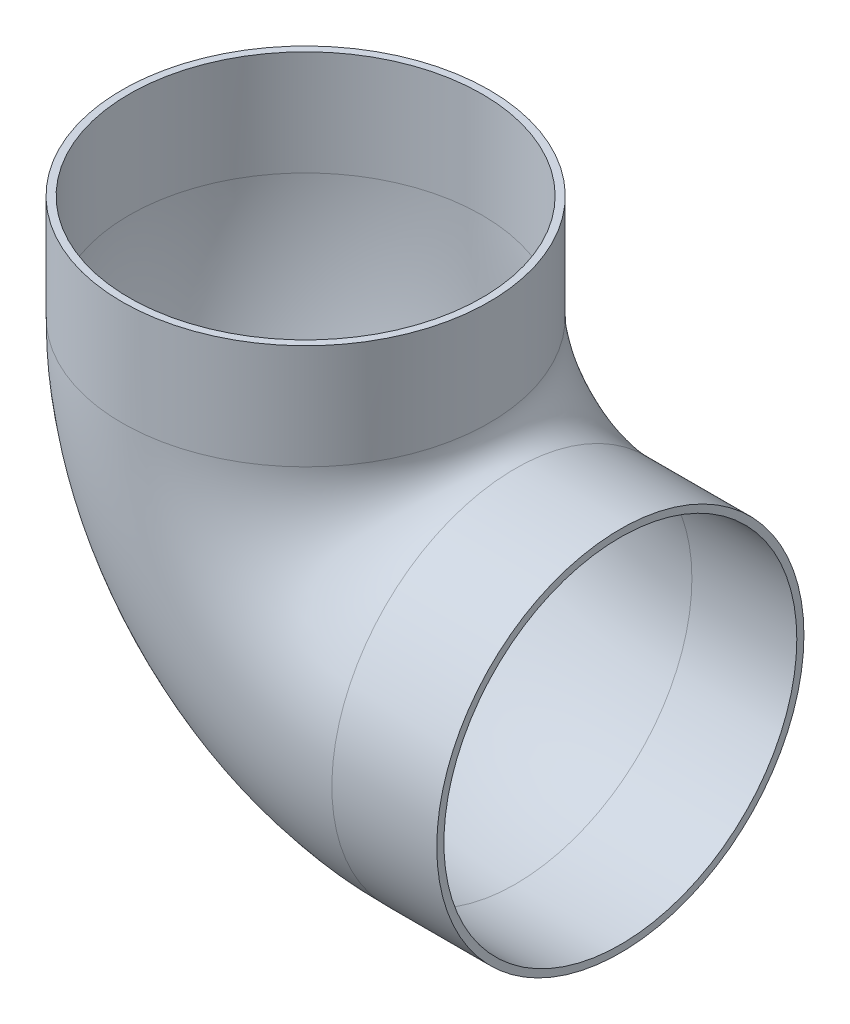
ISO-10303-21;
HEADER;
FILE_DESCRIPTION(('STEP AP214'),'2;1');
FILE_NAME('part.step','',(''),(''),'','','');
FILE_SCHEMA(('AUTOMOTIVE_DESIGN { 1 0 10303 214 1 1 1 1 }'));
ENDSEC;
DATA;
#1=APPLICATION_CONTEXT('core data for automotive mechanical design processes');
#2=APPLICATION_PROTOCOL_DEFINITION('international standard','automotive_design',2000,#1);
#3=PRODUCT_CONTEXT('',#1,'mechanical');
#4=PRODUCT('Part','Part','',(#3));
#5=PRODUCT_RELATED_PRODUCT_CATEGORY('part','',(#4));
#6=PRODUCT_DEFINITION_FORMATION('','',#4);
#7=PRODUCT_DEFINITION_CONTEXT('part definition',#1,'design');
#8=PRODUCT_DEFINITION('design','',#6,#7);
#9=PRODUCT_DEFINITION_SHAPE('','',#8);
#10=(LENGTH_UNIT() NAMED_UNIT(*) SI_UNIT(.MILLI.,.METRE.));
#11=(NAMED_UNIT(*) PLANE_ANGLE_UNIT() SI_UNIT($,.RADIAN.));
#12=(NAMED_UNIT(*) SI_UNIT($,.STERADIAN.) SOLID_ANGLE_UNIT());
#13=UNCERTAINTY_MEASURE_WITH_UNIT(LENGTH_MEASURE(1.E-05),#10,'distance_accuracy_value','');
#14=(GEOMETRIC_REPRESENTATION_CONTEXT(3) GLOBAL_UNCERTAINTY_ASSIGNED_CONTEXT((#13)) GLOBAL_UNIT_ASSIGNED_CONTEXT((#10,
#11,#12)) REPRESENTATION_CONTEXT('',''));
#15=CARTESIAN_POINT('',(0.,0.,0.));
#16=DIRECTION('',(0.,0.,1.));
#17=DIRECTION('',(1.,0.,0.));
#18=AXIS2_PLACEMENT_3D('',#15,#16,#17);
#19=CARTESIAN_POINT('',(-18.2819336381959,1.9177575258447,0.));
#20=DIRECTION('',(0.,-1.,0.));
#21=DIRECTION('',(1.,0.,0.));
#22=AXIS2_PLACEMENT_3D('',#19,#20,#21);
#23=CYLINDRICAL_SURFACE('',#22,11.1125);
#24=CARTESIAN_POINT('',(-18.2819336381959,-4.4322424741553,0.));
#25=DIRECTION('',(0.,-1.,0.));
#26=DIRECTION('',(0.,0.,-1.));
#27=AXIS2_PLACEMENT_3D('',#24,#25,#26);
#28=CIRCLE('',#27,11.1125);
#29=CARTESIAN_POINT('',(-29.3944336381959,-4.4322424741553,0.));
#30=VERTEX_POINT('',#29);
#31=EDGE_CURVE('E83',#30,#30,#28,.T.);
#32=ORIENTED_EDGE('',*,*,#31,.F.);
#33=EDGE_LOOP('',(#32));
#34=FACE_BOUND('',#33,.T.);
#35=CARTESIAN_POINT('',(-18.2819336381959,1.9177575258447,0.));
#36=DIRECTION('',(0.,-1.,0.));
#37=DIRECTION('',(0.,0.,-1.));
#38=AXIS2_PLACEMENT_3D('',#35,#36,#37);
#39=CIRCLE('',#38,11.1125);
#40=CARTESIAN_POINT('',(-18.2819336381959,1.9177575258447,-11.1125));
#41=VERTEX_POINT('',#40);
#42=EDGE_CURVE('E52',#41,#41,#39,.T.);
#43=ORIENTED_EDGE('',*,*,#42,.T.);
#44=EDGE_LOOP('',(#43));
#45=FACE_BOUND('',#44,.T.);
#46=ADVANCED_FACE('F37',(#34,#45),#23,.T.);
#47=CARTESIAN_POINT('',(-5.58193363819594,-4.4322424741553,0.));
#48=DIRECTION('',(0.,0.,1.));
#49=DIRECTION('',(1.,0.,0.));
#50=AXIS2_PLACEMENT_3D('',#47,#48,#49);
#51=TOROIDAL_SURFACE('',#50,12.7,11.1125);
#52=CARTESIAN_POINT('',(-5.58193363819594,-17.1322424741553,0.));
#53=DIRECTION('',(1.,0.,0.));
#54=DIRECTION('',(0.,0.,-1.));
#55=AXIS2_PLACEMENT_3D('',#52,#53,#54);
#56=CIRCLE('',#55,11.1125);
#57=CARTESIAN_POINT('',(-5.58193363819593,-28.2447424741553,0.));
#58=VERTEX_POINT('',#57);
#59=EDGE_CURVE('E41',#58,#58,#56,.T.);
#60=CARTESIAN_POINT('',(-5.58193363819594,-4.4322424741553,0.));
#61=DIRECTION('',(0.,0.,1.));
#62=DIRECTION('',(1.,0.,0.));
#63=AXIS2_PLACEMENT_3D('',#60,#61,#62);
#64=CIRCLE('',#63,23.8125);
#65=EDGE_CURVE('',#30,#58,#64,.T.);
#66=ORIENTED_EDGE('',*,*,#31,.T.);
#67=ORIENTED_EDGE('',*,*,#59,.F.);
#68=ORIENTED_EDGE('',*,*,#65,.T.);
#69=ORIENTED_EDGE('',*,*,#65,.F.);
#70=EDGE_LOOP('',(#66,#68,#67,#69));
#71=FACE_BOUND('',#70,.T.);
#72=ADVANCED_FACE('F91',(#71),#51,.T.);
#73=CARTESIAN_POINT('',(-5.58193363819594,-17.1322424741553,0.));
#74=DIRECTION('',(1.,0.,0.));
#75=DIRECTION('',(0.,0.,-1.));
#76=AXIS2_PLACEMENT_3D('',#73,#74,#75);
#77=CYLINDRICAL_SURFACE('',#76,11.1125);
#78=CARTESIAN_POINT('',(0.768066361804061,-17.1322424741553,0.));
#79=DIRECTION('',(1.,0.,0.));
#80=DIRECTION('',(0.,0.,-1.));
#81=AXIS2_PLACEMENT_3D('',#78,#79,#80);
#82=CIRCLE('',#81,11.1125);
#83=CARTESIAN_POINT('',(0.768066361804061,-17.1322424741553,-11.1125));
#84=VERTEX_POINT('',#83);
#85=EDGE_CURVE('E57',#84,#84,#82,.T.);
#86=ORIENTED_EDGE('',*,*,#85,.F.);
#87=EDGE_LOOP('',(#86));
#88=FACE_BOUND('',#87,.T.);
#89=ORIENTED_EDGE('',*,*,#59,.T.);
#90=EDGE_LOOP('',(#89));
#91=FACE_BOUND('',#90,.T.);
#92=ADVANCED_FACE('F39',(#88,#91),#77,.T.);
#93=CARTESIAN_POINT('',(-18.2819336381959,1.9177575258447,0.));
#94=DIRECTION('',(0.,-1.,0.));
#95=DIRECTION('',(0.,0.,-1.));
#96=AXIS2_PLACEMENT_3D('',#93,#94,#95);
#97=PLANE('',#96);
#98=CARTESIAN_POINT('',(-18.2819336381959,1.9177575258447,0.));
#99=DIRECTION('',(0.,-1.,0.));
#100=DIRECTION('',(0.,0.,-1.));
#101=AXIS2_PLACEMENT_3D('',#98,#99,#100);
#102=CIRCLE('',#101,10.6807);
#103=CARTESIAN_POINT('',(-18.2819336381959,1.9177575258447,-10.6807));
#104=VERTEX_POINT('',#103);
#105=EDGE_CURVE('E78',#104,#104,#102,.F.);
#106=ORIENTED_EDGE('',*,*,#105,.F.);
#107=EDGE_LOOP('',(#106));
#108=FACE_BOUND('',#107,.T.);
#109=ORIENTED_EDGE('',*,*,#42,.F.);
#110=EDGE_LOOP('',(#109));
#111=FACE_BOUND('',#110,.T.);
#112=ADVANCED_FACE('F97',(#108,#111),#97,.F.);
#113=CARTESIAN_POINT('',(0.768066361804061,-17.1322424741553,0.));
#114=DIRECTION('',(1.,0.,0.));
#115=DIRECTION('',(0.,0.,-1.));
#116=AXIS2_PLACEMENT_3D('',#113,#114,#115);
#117=PLANE('',#116);
#118=CARTESIAN_POINT('',(0.768066361804061,-17.1322424741553,0.));
#119=DIRECTION('',(1.,0.,0.));
#120=DIRECTION('',(0.,0.,-1.));
#121=AXIS2_PLACEMENT_3D('',#118,#119,#120);
#122=CIRCLE('',#121,10.6807);
#123=CARTESIAN_POINT('',(0.768066361804061,-17.1322424741553,-10.6807));
#124=VERTEX_POINT('',#123);
#125=EDGE_CURVE('E11',#124,#124,#122,.F.);
#126=ORIENTED_EDGE('',*,*,#125,.T.);
#127=EDGE_LOOP('',(#126));
#128=FACE_BOUND('',#127,.T.);
#129=ORIENTED_EDGE('',*,*,#85,.T.);
#130=EDGE_LOOP('',(#129));
#131=FACE_BOUND('',#130,.T.);
#132=ADVANCED_FACE('F64',(#128,#131),#117,.T.);
#133=CARTESIAN_POINT('',(-18.2819336381959,1.9177575258447,0.));
#134=DIRECTION('',(0.,-1.,0.));
#135=DIRECTION('',(1.,0.,0.));
#136=AXIS2_PLACEMENT_3D('',#133,#134,#135);
#137=CYLINDRICAL_SURFACE('',#136,10.6807);
#138=CARTESIAN_POINT('',(-18.2819336381959,-4.4322424741553,0.));
#139=DIRECTION('',(0.,-1.,0.));
#140=DIRECTION('',(0.,0.,-1.));
#141=AXIS2_PLACEMENT_3D('',#138,#139,#140);
#142=CIRCLE('',#141,10.6807);
#143=CARTESIAN_POINT('',(-28.9626336381959,-4.4322424741553,0.));
#144=VERTEX_POINT('',#143);
#145=EDGE_CURVE('E75',#144,#144,#142,.F.);
#146=ORIENTED_EDGE('',*,*,#145,.F.);
#147=EDGE_LOOP('',(#146));
#148=FACE_BOUND('',#147,.T.);
#149=ORIENTED_EDGE('',*,*,#105,.T.);
#150=EDGE_LOOP('',(#149));
#151=FACE_BOUND('',#150,.T.);
#152=ADVANCED_FACE('F105',(#148,#151),#137,.F.);
#153=CARTESIAN_POINT('',(-5.58193363819594,-4.4322424741553,0.));
#154=DIRECTION('',(0.,0.,1.));
#155=DIRECTION('',(1.,0.,0.));
#156=AXIS2_PLACEMENT_3D('',#153,#154,#155);
#157=TOROIDAL_SURFACE('',#156,12.7,10.6807);
#158=CARTESIAN_POINT('',(-5.58193363819594,-17.1322424741553,0.));
#159=DIRECTION('',(1.,0.,0.));
#160=DIRECTION('',(0.,0.,-1.));
#161=AXIS2_PLACEMENT_3D('',#158,#159,#160);
#162=CIRCLE('',#161,10.6807);
#163=CARTESIAN_POINT('',(-5.58193363819593,-27.8129424741553,0.));
#164=VERTEX_POINT('',#163);
#165=EDGE_CURVE('E46',#164,#164,#162,.F.);
#166=CARTESIAN_POINT('',(-5.58193363819594,-4.4322424741553,0.));
#167=DIRECTION('',(0.,0.,1.));
#168=DIRECTION('',(1.,0.,0.));
#169=AXIS2_PLACEMENT_3D('',#166,#167,#168);
#170=CIRCLE('',#169,23.3807);
#171=EDGE_CURVE('',#144,#164,#170,.T.);
#172=ORIENTED_EDGE('',*,*,#145,.T.);
#173=ORIENTED_EDGE('',*,*,#165,.F.);
#174=ORIENTED_EDGE('',*,*,#171,.T.);
#175=ORIENTED_EDGE('',*,*,#171,.F.);
#176=EDGE_LOOP('',(#172,#174,#173,#175));
#177=FACE_BOUND('',#176,.T.);
#178=ADVANCED_FACE('F70',(#177),#157,.F.);
#179=CARTESIAN_POINT('',(-5.58193363819594,-17.1322424741553,0.));
#180=DIRECTION('',(1.,0.,0.));
#181=DIRECTION('',(0.,0.,-1.));
#182=AXIS2_PLACEMENT_3D('',#179,#180,#181);
#183=CYLINDRICAL_SURFACE('',#182,10.6807);
#184=ORIENTED_EDGE('',*,*,#125,.F.);
#185=EDGE_LOOP('',(#184));
#186=FACE_BOUND('',#185,.T.);
#187=ORIENTED_EDGE('',*,*,#165,.T.);
#188=EDGE_LOOP('',(#187));
#189=FACE_BOUND('',#188,.T.);
#190=ADVANCED_FACE('F67',(#186,#189),#183,.F.);
#191=CLOSED_SHELL('',(#46,#72,#92,#112,#132,#152,#178,#190));
#192=MANIFOLD_SOLID_BREP('B2',#191);
#193=ADVANCED_BREP_SHAPE_REPRESENTATION('',(#18,#192),#14);
#194=SHAPE_DEFINITION_REPRESENTATION(#9,#193);
ENDSEC;
END-ISO-10303-21;
